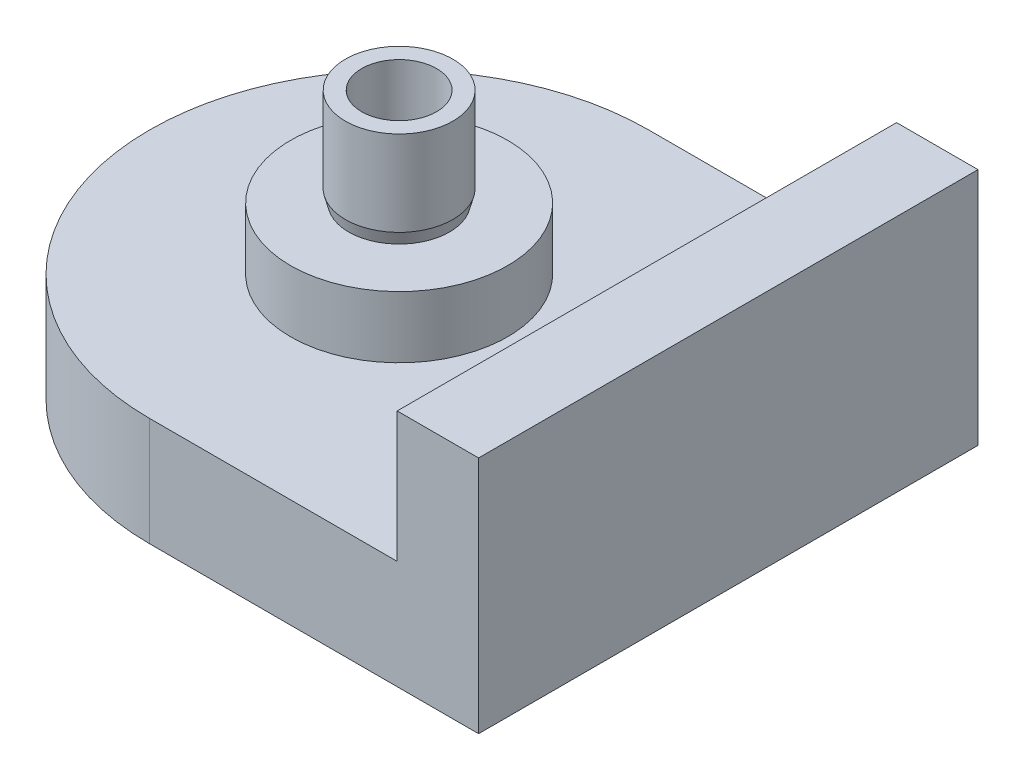
ISO-10303-21;
HEADER;
FILE_DESCRIPTION(('STEP AP214'),'2;1');
FILE_NAME('part.step','',(''),(''),'','','');
FILE_SCHEMA(('AUTOMOTIVE_DESIGN { 1 0 10303 214 1 1 1 1 }'));
ENDSEC;
DATA;
#1=APPLICATION_CONTEXT('core data for automotive mechanical design processes');
#2=APPLICATION_PROTOCOL_DEFINITION('international standard','automotive_design',2000,#1);
#3=PRODUCT_CONTEXT('',#1,'mechanical');
#4=PRODUCT('Part','Part','',(#3));
#5=PRODUCT_RELATED_PRODUCT_CATEGORY('part','',(#4));
#6=PRODUCT_DEFINITION_FORMATION('','',#4);
#7=PRODUCT_DEFINITION_CONTEXT('part definition',#1,'design');
#8=PRODUCT_DEFINITION('design','',#6,#7);
#9=PRODUCT_DEFINITION_SHAPE('','',#8);
#10=(LENGTH_UNIT() NAMED_UNIT(*) SI_UNIT(.MILLI.,.METRE.));
#11=(NAMED_UNIT(*) PLANE_ANGLE_UNIT() SI_UNIT($,.RADIAN.));
#12=(NAMED_UNIT(*) SI_UNIT($,.STERADIAN.) SOLID_ANGLE_UNIT());
#13=UNCERTAINTY_MEASURE_WITH_UNIT(LENGTH_MEASURE(1.E-05),#10,'distance_accuracy_value','');
#14=(GEOMETRIC_REPRESENTATION_CONTEXT(3) GLOBAL_UNCERTAINTY_ASSIGNED_CONTEXT((#13)) GLOBAL_UNIT_ASSIGNED_CONTEXT((#10,
#11,#12)) REPRESENTATION_CONTEXT('',''));
#15=CARTESIAN_POINT('',(0.,0.,0.));
#16=DIRECTION('',(0.,0.,1.));
#17=DIRECTION('',(1.,0.,0.));
#18=AXIS2_PLACEMENT_3D('',#15,#16,#17);
#19=CARTESIAN_POINT('',(0.,5.,0.));
#20=DIRECTION('',(0.,1.,0.));
#21=DIRECTION('',(0.,0.,1.));
#22=AXIS2_PLACEMENT_3D('',#19,#20,#21);
#23=PLANE('',#22);
#24=CARTESIAN_POINT('',(0.,5.,0.));
#25=DIRECTION('',(0.,1.,0.));
#26=DIRECTION('',(0.,0.,1.));
#27=AXIS2_PLACEMENT_3D('',#24,#25,#26);
#28=CIRCLE('',#27,5.);
#29=CARTESIAN_POINT('',(0.,5.,5.));
#30=VERTEX_POINT('',#29);
#31=EDGE_CURVE('E238',#30,#30,#28,.T.);
#32=ORIENTED_EDGE('',*,*,#31,.F.);
#33=EDGE_LOOP('',(#32));
#34=FACE_BOUND('',#33,.T.);
#35=DIRECTION('',(-1.,0.,0.));
#36=VECTOR('',#35,1.);
#37=CARTESIAN_POINT('',(0.,5.,11.5));
#38=LINE('',#37,#36);
#39=CARTESIAN_POINT('',(11.4102698840265,5.,11.5));
#40=VERTEX_POINT('',#39);
#41=CARTESIAN_POINT('',(0.,5.,11.5));
#42=VERTEX_POINT('',#41);
#43=EDGE_CURVE('E58',#40,#42,#38,.T.);
#44=ORIENTED_EDGE('',*,*,#43,.F.);
#45=DIRECTION('',(0.,0.,1.));
#46=VECTOR('',#45,1.);
#47=CARTESIAN_POINT('',(11.4102698840265,5.,-11.5));
#48=LINE('',#47,#46);
#49=CARTESIAN_POINT('',(11.4102698840265,5.,4.));
#50=VERTEX_POINT('',#49);
#51=EDGE_CURVE('E152',#50,#40,#48,.T.);
#52=ORIENTED_EDGE('',*,*,#51,.F.);
#53=DIRECTION('',(1.,0.,0.));
#54=VECTOR('',#53,1.);
#55=CARTESIAN_POINT('',(0.,5.,4.));
#56=LINE('',#55,#54);
#57=CARTESIAN_POINT('',(10.3102698840265,5.,4.));
#58=VERTEX_POINT('',#57);
#59=EDGE_CURVE('E172',#58,#50,#56,.T.);
#60=ORIENTED_EDGE('',*,*,#59,.F.);
#61=DIRECTION('',(0.,0.,1.));
#62=VECTOR('',#61,1.);
#63=CARTESIAN_POINT('',(10.3102698840265,5.,0.));
#64=LINE('',#63,#62);
#65=CARTESIAN_POINT('',(10.3102698840265,5.,-4.));
#66=VERTEX_POINT('',#65);
#67=EDGE_CURVE('E168',#66,#58,#64,.T.);
#68=ORIENTED_EDGE('',*,*,#67,.F.);
#69=DIRECTION('',(1.,0.,0.));
#70=VECTOR('',#69,1.);
#71=CARTESIAN_POINT('',(0.,5.,-4.00000000000001));
#72=LINE('',#71,#70);
#73=CARTESIAN_POINT('',(11.4102698840265,5.,-4.));
#74=VERTEX_POINT('',#73);
#75=EDGE_CURVE('E165',#66,#74,#72,.T.);
#76=ORIENTED_EDGE('',*,*,#75,.T.);
#77=CARTESIAN_POINT('',(11.4102698840265,5.,-11.5));
#78=VERTEX_POINT('',#77);
#79=EDGE_CURVE('E65',#78,#74,#48,.T.);
#80=ORIENTED_EDGE('',*,*,#79,.F.);
#81=DIRECTION('',(1.,0.,0.));
#82=VECTOR('',#81,1.);
#83=CARTESIAN_POINT('',(0.,5.,-11.5));
#84=LINE('',#83,#82);
#85=CARTESIAN_POINT('',(0.,5.,-11.5));
#86=VERTEX_POINT('',#85);
#87=EDGE_CURVE('E189',#86,#78,#84,.T.);
#88=ORIENTED_EDGE('',*,*,#87,.F.);
#89=CARTESIAN_POINT('',(0.,5.,0.));
#90=DIRECTION('',(0.,1.,0.));
#91=DIRECTION('',(0.,0.,1.));
#92=AXIS2_PLACEMENT_3D('',#89,#90,#91);
#93=CIRCLE('',#92,11.5);
#94=EDGE_CURVE('E243',#86,#42,#93,.T.);
#95=ORIENTED_EDGE('',*,*,#94,.T.);
#96=EDGE_LOOP('',(#44,#52,#60,#68,#76,#80,#88,#95));
#97=FACE_BOUND('',#96,.T.);
#98=ADVANCED_FACE('F42',(#34,#97),#23,.T.);
#99=CARTESIAN_POINT('',(0.,0.,0.));
#100=DIRECTION('',(0.,1.,0.));
#101=DIRECTION('',(0.,0.,1.));
#102=AXIS2_PLACEMENT_3D('',#99,#100,#101);
#103=PLANE('',#102);
#104=CARTESIAN_POINT('',(0.,0.,0.));
#105=DIRECTION('',(0.,1.,0.));
#106=DIRECTION('',(0.,0.,1.));
#107=AXIS2_PLACEMENT_3D('',#104,#105,#106);
#108=CIRCLE('',#107,1.8);
#109=CARTESIAN_POINT('',(0.,0.,1.8));
#110=VERTEX_POINT('',#109);
#111=EDGE_CURVE('E216',#110,#110,#108,.T.);
#112=ORIENTED_EDGE('',*,*,#111,.T.);
#113=EDGE_LOOP('',(#112));
#114=FACE_BOUND('',#113,.T.);
#115=CARTESIAN_POINT('',(0.,0.,0.));
#116=DIRECTION('',(0.,1.,0.));
#117=DIRECTION('',(0.,0.,1.));
#118=AXIS2_PLACEMENT_3D('',#115,#116,#117);
#119=CIRCLE('',#118,11.5);
#120=CARTESIAN_POINT('',(0.,0.,-11.5));
#121=VERTEX_POINT('',#120);
#122=CARTESIAN_POINT('',(0.,0.,11.5));
#123=VERTEX_POINT('',#122);
#124=EDGE_CURVE('E237',#121,#123,#119,.T.);
#125=ORIENTED_EDGE('',*,*,#124,.F.);
#126=DIRECTION('',(1.,0.,0.));
#127=VECTOR('',#126,1.);
#128=CARTESIAN_POINT('',(0.,0.,-11.5));
#129=LINE('',#128,#127);
#130=CARTESIAN_POINT('',(15.1602698840265,0.,-11.5));
#131=VERTEX_POINT('',#130);
#132=EDGE_CURVE('E180',#121,#131,#129,.T.);
#133=ORIENTED_EDGE('',*,*,#132,.T.);
#134=DIRECTION('',(0.,0.,1.));
#135=VECTOR('',#134,1.);
#136=CARTESIAN_POINT('',(15.1602698840265,0.,11.5));
#137=LINE('',#136,#135);
#138=CARTESIAN_POINT('',(15.1602698840265,0.,11.5));
#139=VERTEX_POINT('',#138);
#140=EDGE_CURVE('E127',#131,#139,#137,.T.);
#141=ORIENTED_EDGE('',*,*,#140,.T.);
#142=DIRECTION('',(-1.,0.,0.));
#143=VECTOR('',#142,1.);
#144=CARTESIAN_POINT('',(0.,0.,11.5));
#145=LINE('',#144,#143);
#146=EDGE_CURVE('E192',#139,#123,#145,.T.);
#147=ORIENTED_EDGE('',*,*,#146,.T.);
#148=EDGE_LOOP('',(#125,#133,#141,#147));
#149=FACE_BOUND('',#148,.T.);
#150=DIRECTION('',(0.,0.,1.));
#151=VECTOR('',#150,1.);
#152=CARTESIAN_POINT('',(11.4102698840265,0.,0.));
#153=LINE('',#152,#151);
#154=CARTESIAN_POINT('',(11.4102698840265,0.,-4.));
#155=VERTEX_POINT('',#154);
#156=CARTESIAN_POINT('',(11.4102698840265,0.,4.));
#157=VERTEX_POINT('',#156);
#158=EDGE_CURVE('E12',#155,#157,#153,.T.);
#159=ORIENTED_EDGE('',*,*,#158,.F.);
#160=DIRECTION('',(1.,0.,0.));
#161=VECTOR('',#160,1.);
#162=CARTESIAN_POINT('',(0.,0.,-4.00000000000001));
#163=LINE('',#162,#161);
#164=CARTESIAN_POINT('',(10.3102698840265,0.,-4.));
#165=VERTEX_POINT('',#164);
#166=EDGE_CURVE('E242',#165,#155,#163,.T.);
#167=ORIENTED_EDGE('',*,*,#166,.F.);
#168=DIRECTION('',(0.,0.,1.));
#169=VECTOR('',#168,1.);
#170=CARTESIAN_POINT('',(10.3102698840265,0.,0.));
#171=LINE('',#170,#169);
#172=CARTESIAN_POINT('',(10.3102698840265,0.,4.));
#173=VERTEX_POINT('',#172);
#174=EDGE_CURVE('E256',#165,#173,#171,.T.);
#175=ORIENTED_EDGE('',*,*,#174,.T.);
#176=DIRECTION('',(1.,0.,0.));
#177=VECTOR('',#176,1.);
#178=CARTESIAN_POINT('',(0.,0.,4.));
#179=LINE('',#178,#177);
#180=EDGE_CURVE('E51',#173,#157,#179,.T.);
#181=ORIENTED_EDGE('',*,*,#180,.T.);
#182=EDGE_LOOP('',(#159,#167,#175,#181));
#183=FACE_BOUND('',#182,.T.);
#184=ADVANCED_FACE('F263',(#114,#149,#183),#103,.F.);
#185=CARTESIAN_POINT('',(0.,5.,0.));
#186=DIRECTION('',(0.,-1.,0.));
#187=DIRECTION('',(0.,0.,-1.));
#188=AXIS2_PLACEMENT_3D('',#185,#186,#187);
#189=CYLINDRICAL_SURFACE('',#188,11.5);
#190=DIRECTION('',(0.,-1.,0.));
#191=VECTOR('',#190,1.);
#192=CARTESIAN_POINT('',(0.,5.,11.5));
#193=LINE('',#192,#191);
#194=EDGE_CURVE('E202',#42,#123,#193,.T.);
#195=ORIENTED_EDGE('',*,*,#194,.F.);
#196=ORIENTED_EDGE('',*,*,#94,.F.);
#197=DIRECTION('',(0.,-1.,0.));
#198=VECTOR('',#197,1.);
#199=CARTESIAN_POINT('',(0.,5.,-11.5));
#200=LINE('',#199,#198);
#201=EDGE_CURVE('E133',#86,#121,#200,.T.);
#202=ORIENTED_EDGE('',*,*,#201,.T.);
#203=ORIENTED_EDGE('',*,*,#124,.T.);
#204=EDGE_LOOP('',(#195,#196,#202,#203));
#205=FACE_BOUND('',#204,.T.);
#206=ADVANCED_FACE('F44',(#205),#189,.T.);
#207=CARTESIAN_POINT('',(0.,7.84,0.));
#208=DIRECTION('',(0.,-1.,0.));
#209=DIRECTION('',(0.,0.,-1.));
#210=AXIS2_PLACEMENT_3D('',#207,#208,#209);
#211=CYLINDRICAL_SURFACE('',#210,5.);
#212=CARTESIAN_POINT('',(0.,7.84,0.));
#213=DIRECTION('',(0.,1.,0.));
#214=DIRECTION('',(0.,0.,1.));
#215=AXIS2_PLACEMENT_3D('',#212,#213,#214);
#216=CIRCLE('',#215,5.);
#217=CARTESIAN_POINT('',(0.,7.84,5.));
#218=VERTEX_POINT('',#217);
#219=EDGE_CURVE('E233',#218,#218,#216,.T.);
#220=ORIENTED_EDGE('',*,*,#219,.F.);
#221=EDGE_LOOP('',(#220));
#222=FACE_BOUND('',#221,.T.);
#223=ORIENTED_EDGE('',*,*,#31,.T.);
#224=EDGE_LOOP('',(#223));
#225=FACE_BOUND('',#224,.T.);
#226=ADVANCED_FACE('F299',(#222,#225),#211,.T.);
#227=CARTESIAN_POINT('',(0.,7.84,0.));
#228=DIRECTION('',(0.,1.,0.));
#229=DIRECTION('',(0.,0.,1.));
#230=AXIS2_PLACEMENT_3D('',#227,#228,#229);
#231=PLANE('',#230);
#232=ORIENTED_EDGE('',*,*,#219,.T.);
#233=EDGE_LOOP('',(#232));
#234=FACE_BOUND('',#233,.T.);
#235=CARTESIAN_POINT('',(0.,7.84,0.));
#236=DIRECTION('',(0.,1.,0.));
#237=DIRECTION('',(0.,0.,1.));
#238=AXIS2_PLACEMENT_3D('',#235,#236,#237);
#239=CIRCLE('',#238,2.32079933352687);
#240=CARTESIAN_POINT('',(0.,7.84,2.32079933352687));
#241=VERTEX_POINT('',#240);
#242=EDGE_CURVE('E206',#241,#241,#239,.T.);
#243=ORIENTED_EDGE('',*,*,#242,.F.);
#244=EDGE_LOOP('',(#243));
#245=FACE_BOUND('',#244,.T.);
#246=ADVANCED_FACE('F302',(#234,#245),#231,.T.);
#247=CARTESIAN_POINT('',(0.,12.34,0.));
#248=DIRECTION('',(0.,1.,0.));
#249=DIRECTION('',(0.,0.,1.));
#250=AXIS2_PLACEMENT_3D('',#247,#248,#249);
#251=PLANE('',#250);
#252=CARTESIAN_POINT('',(0.,12.34,0.));
#253=DIRECTION('',(0.,1.,0.));
#254=DIRECTION('',(0.,0.,1.));
#255=AXIS2_PLACEMENT_3D('',#252,#253,#254);
#256=CIRCLE('',#255,2.475);
#257=CARTESIAN_POINT('',(0.,12.34,2.475));
#258=VERTEX_POINT('',#257);
#259=EDGE_CURVE('E229',#258,#258,#256,.T.);
#260=ORIENTED_EDGE('',*,*,#259,.T.);
#261=EDGE_LOOP('',(#260));
#262=FACE_BOUND('',#261,.T.);
#263=CARTESIAN_POINT('',(0.,12.34,0.));
#264=DIRECTION('',(0.,1.,0.));
#265=DIRECTION('',(0.,0.,1.));
#266=AXIS2_PLACEMENT_3D('',#263,#264,#265);
#267=CIRCLE('',#266,1.725);
#268=CARTESIAN_POINT('',(0.,12.34,1.725));
#269=VERTEX_POINT('',#268);
#270=EDGE_CURVE('E225',#269,#269,#267,.T.);
#271=ORIENTED_EDGE('',*,*,#270,.F.);
#272=EDGE_LOOP('',(#271));
#273=FACE_BOUND('',#272,.T.);
#274=ADVANCED_FACE('F306',(#262,#273),#251,.T.);
#275=CARTESIAN_POINT('',(0.,12.34,0.));
#276=DIRECTION('',(0.,-1.,0.));
#277=DIRECTION('',(0.,0.,-1.));
#278=AXIS2_PLACEMENT_3D('',#275,#276,#277);
#279=CYLINDRICAL_SURFACE('',#278,2.475);
#280=CARTESIAN_POINT('',(0.,8.41548472183872,0.));
#281=DIRECTION('',(0.,1.,0.));
#282=DIRECTION('',(0.,0.,1.));
#283=AXIS2_PLACEMENT_3D('',#280,#281,#282);
#284=CIRCLE('',#283,2.475);
#285=CARTESIAN_POINT('',(0.,8.41548472183872,2.475));
#286=VERTEX_POINT('',#285);
#287=EDGE_CURVE('E215',#286,#286,#284,.T.);
#288=ORIENTED_EDGE('',*,*,#287,.T.);
#289=EDGE_LOOP('',(#288));
#290=FACE_BOUND('',#289,.T.);
#291=ORIENTED_EDGE('',*,*,#259,.F.);
#292=EDGE_LOOP('',(#291));
#293=FACE_BOUND('',#292,.T.);
#294=ADVANCED_FACE('F308',(#290,#293),#279,.T.);
#295=CARTESIAN_POINT('',(0.,12.34,0.));
#296=DIRECTION('',(0.,-1.,0.));
#297=DIRECTION('',(0.,0.,-1.));
#298=AXIS2_PLACEMENT_3D('',#295,#296,#297);
#299=CYLINDRICAL_SURFACE('',#298,1.725);
#300=ORIENTED_EDGE('',*,*,#270,.T.);
#301=EDGE_LOOP('',(#300));
#302=FACE_BOUND('',#301,.T.);
#303=CARTESIAN_POINT('',(0.,7.84,0.));
#304=DIRECTION('',(0.,1.,0.));
#305=DIRECTION('',(0.,0.,1.));
#306=AXIS2_PLACEMENT_3D('',#303,#304,#305);
#307=CIRCLE('',#306,1.725);
#308=CARTESIAN_POINT('',(0.,7.84,1.725));
#309=VERTEX_POINT('',#308);
#310=EDGE_CURVE('E220',#309,#309,#307,.F.);
#311=ORIENTED_EDGE('',*,*,#310,.T.);
#312=EDGE_LOOP('',(#311));
#313=FACE_BOUND('',#312,.T.);
#314=ADVANCED_FACE('F311',(#302,#313),#299,.F.);
#315=CARTESIAN_POINT('',(0.,7.84,0.));
#316=DIRECTION('',(0.,1.,0.));
#317=DIRECTION('',(0.,0.,1.));
#318=AXIS2_PLACEMENT_3D('',#315,#316,#317);
#319=PLANE('',#318);
#320=CARTESIAN_POINT('',(0.,7.84,0.));
#321=DIRECTION('',(0.,1.,0.));
#322=DIRECTION('',(0.,0.,1.));
#323=AXIS2_PLACEMENT_3D('',#320,#321,#322);
#324=CIRCLE('',#323,1.8);
#325=CARTESIAN_POINT('',(0.,7.84,1.8));
#326=VERTEX_POINT('',#325);
#327=EDGE_CURVE('E221',#326,#326,#324,.T.);
#328=ORIENTED_EDGE('',*,*,#327,.F.);
#329=EDGE_LOOP('',(#328));
#330=FACE_BOUND('',#329,.T.);
#331=ORIENTED_EDGE('',*,*,#310,.F.);
#332=EDGE_LOOP('',(#331));
#333=FACE_BOUND('',#332,.T.);
#334=ADVANCED_FACE('F318',(#330,#333),#319,.F.);
#335=CARTESIAN_POINT('',(0.,0.,0.));
#336=DIRECTION('',(0.,1.,0.));
#337=DIRECTION('',(0.,0.,1.));
#338=AXIS2_PLACEMENT_3D('',#335,#336,#337);
#339=CYLINDRICAL_SURFACE('',#338,1.8);
#340=ORIENTED_EDGE('',*,*,#111,.F.);
#341=EDGE_LOOP('',(#340));
#342=FACE_BOUND('',#341,.T.);
#343=ORIENTED_EDGE('',*,*,#327,.T.);
#344=EDGE_LOOP('',(#343));
#345=FACE_BOUND('',#344,.T.);
#346=ADVANCED_FACE('F320',(#342,#345),#339,.F.);
#347=CARTESIAN_POINT('',(0.,7.84,0.));
#348=DIRECTION('',(0.,1.,0.));
#349=DIRECTION('',(0.,0.,1.));
#350=AXIS2_PLACEMENT_3D('',#347,#348,#349);
#351=CONICAL_SURFACE('',#350,2.32079933352687,0.26179938779915);
#352=ORIENTED_EDGE('',*,*,#242,.T.);
#353=EDGE_LOOP('',(#352));
#354=FACE_BOUND('',#353,.T.);
#355=ORIENTED_EDGE('',*,*,#287,.F.);
#356=EDGE_LOOP('',(#355));
#357=FACE_BOUND('',#356,.T.);
#358=ADVANCED_FACE('F323',(#354,#357),#351,.T.);
#359=CARTESIAN_POINT('',(0.,5.,11.5));
#360=DIRECTION('',(0.,0.,1.));
#361=DIRECTION('',(1.,0.,0.));
#362=AXIS2_PLACEMENT_3D('',#359,#360,#361);
#363=PLANE('',#362);
#364=ORIENTED_EDGE('',*,*,#146,.F.);
#365=DIRECTION('',(0.,-1.,0.));
#366=VECTOR('',#365,1.);
#367=CARTESIAN_POINT('',(15.1602698840265,5.,11.5));
#368=LINE('',#367,#366);
#369=CARTESIAN_POINT('',(15.1602698840265,11.,11.5));
#370=VERTEX_POINT('',#369);
#371=EDGE_CURVE('E132',#370,#139,#368,.T.);
#372=ORIENTED_EDGE('',*,*,#371,.F.);
#373=DIRECTION('',(1.,0.,0.));
#374=VECTOR('',#373,1.);
#375=CARTESIAN_POINT('',(15.1602698840265,11.,11.5));
#376=LINE('',#375,#374);
#377=CARTESIAN_POINT('',(11.4102698840265,11.,11.5));
#378=VERTEX_POINT('',#377);
#379=EDGE_CURVE('E148',#378,#370,#376,.T.);
#380=ORIENTED_EDGE('',*,*,#379,.F.);
#381=DIRECTION('',(0.,-1.,0.));
#382=VECTOR('',#381,1.);
#383=CARTESIAN_POINT('',(11.4102698840265,11.,11.5));
#384=LINE('',#383,#382);
#385=EDGE_CURVE('E158',#378,#40,#384,.T.);
#386=ORIENTED_EDGE('',*,*,#385,.T.);
#387=ORIENTED_EDGE('',*,*,#43,.T.);
#388=ORIENTED_EDGE('',*,*,#194,.T.);
#389=EDGE_LOOP('',(#364,#372,#380,#386,#387,#388));
#390=FACE_BOUND('',#389,.T.);
#391=ADVANCED_FACE('F330',(#390),#363,.T.);
#392=CARTESIAN_POINT('',(15.1602698840265,5.,11.5));
#393=DIRECTION('',(1.,0.,0.));
#394=DIRECTION('',(0.,0.,-1.));
#395=AXIS2_PLACEMENT_3D('',#392,#393,#394);
#396=PLANE('',#395);
#397=ORIENTED_EDGE('',*,*,#140,.F.);
#398=DIRECTION('',(0.,-1.,0.));
#399=VECTOR('',#398,1.);
#400=CARTESIAN_POINT('',(15.1602698840265,5.,-11.5));
#401=LINE('',#400,#399);
#402=CARTESIAN_POINT('',(15.1602698840265,11.,-11.5));
#403=VERTEX_POINT('',#402);
#404=EDGE_CURVE('E121',#403,#131,#401,.T.);
#405=ORIENTED_EDGE('',*,*,#404,.F.);
#406=DIRECTION('',(0.,0.,-1.));
#407=VECTOR('',#406,1.);
#408=CARTESIAN_POINT('',(15.1602698840265,11.,-11.5));
#409=LINE('',#408,#407);
#410=EDGE_CURVE('E125',#370,#403,#409,.T.);
#411=ORIENTED_EDGE('',*,*,#410,.F.);
#412=ORIENTED_EDGE('',*,*,#371,.T.);
#413=EDGE_LOOP('',(#397,#405,#411,#412));
#414=FACE_BOUND('',#413,.T.);
#415=ADVANCED_FACE('F123',(#414),#396,.T.);
#416=CARTESIAN_POINT('',(0.,5.,-11.5));
#417=DIRECTION('',(0.,0.,-1.));
#418=DIRECTION('',(-1.,0.,0.));
#419=AXIS2_PLACEMENT_3D('',#416,#417,#418);
#420=PLANE('',#419);
#421=ORIENTED_EDGE('',*,*,#132,.F.);
#422=ORIENTED_EDGE('',*,*,#201,.F.);
#423=ORIENTED_EDGE('',*,*,#87,.T.);
#424=DIRECTION('',(0.,-1.,0.));
#425=VECTOR('',#424,1.);
#426=CARTESIAN_POINT('',(11.4102698840265,11.,-11.5));
#427=LINE('',#426,#425);
#428=CARTESIAN_POINT('',(11.4102698840265,11.,-11.5));
#429=VERTEX_POINT('',#428);
#430=EDGE_CURVE('E139',#429,#78,#427,.T.);
#431=ORIENTED_EDGE('',*,*,#430,.F.);
#432=DIRECTION('',(-1.,0.,0.));
#433=VECTOR('',#432,1.);
#434=CARTESIAN_POINT('',(15.1602698840265,11.,-11.5));
#435=LINE('',#434,#433);
#436=EDGE_CURVE('E136',#403,#429,#435,.T.);
#437=ORIENTED_EDGE('',*,*,#436,.F.);
#438=ORIENTED_EDGE('',*,*,#404,.T.);
#439=EDGE_LOOP('',(#421,#422,#423,#431,#437,#438));
#440=FACE_BOUND('',#439,.T.);
#441=ADVANCED_FACE('F137',(#440),#420,.T.);
#442=CARTESIAN_POINT('',(11.4102698840265,-5.,0.));
#443=DIRECTION('',(-1.,0.,0.));
#444=DIRECTION('',(0.,0.,1.));
#445=AXIS2_PLACEMENT_3D('',#442,#443,#444);
#446=PLANE('',#445);
#447=ORIENTED_EDGE('',*,*,#158,.T.);
#448=DIRECTION('',(0.,1.,0.));
#449=VECTOR('',#448,1.);
#450=CARTESIAN_POINT('',(11.4102698840265,-5.,4.));
#451=LINE('',#450,#449);
#452=EDGE_CURVE('E176',#157,#50,#451,.T.);
#453=ORIENTED_EDGE('',*,*,#452,.T.);
#454=ORIENTED_EDGE('',*,*,#51,.T.);
#455=ORIENTED_EDGE('',*,*,#385,.F.);
#456=DIRECTION('',(0.,0.,1.));
#457=VECTOR('',#456,1.);
#458=CARTESIAN_POINT('',(11.4102698840265,11.,-11.5));
#459=LINE('',#458,#457);
#460=EDGE_CURVE('E143',#429,#378,#459,.T.);
#461=ORIENTED_EDGE('',*,*,#460,.F.);
#462=ORIENTED_EDGE('',*,*,#430,.T.);
#463=ORIENTED_EDGE('',*,*,#79,.T.);
#464=DIRECTION('',(0.,1.,0.));
#465=VECTOR('',#464,1.);
#466=CARTESIAN_POINT('',(11.4102698840265,-5.,-4.));
#467=LINE('',#466,#465);
#468=EDGE_CURVE('E175',#155,#74,#467,.T.);
#469=ORIENTED_EDGE('',*,*,#468,.F.);
#470=EDGE_LOOP('',(#447,#453,#454,#455,#461,#462,#463,#469));
#471=FACE_BOUND('',#470,.T.);
#472=ADVANCED_FACE('F276',(#471),#446,.T.);
#473=CARTESIAN_POINT('',(0.,-5.,4.));
#474=DIRECTION('',(0.,0.,1.));
#475=DIRECTION('',(1.,0.,0.));
#476=AXIS2_PLACEMENT_3D('',#473,#474,#475);
#477=PLANE('',#476);
#478=DIRECTION('',(0.,1.,0.));
#479=VECTOR('',#478,1.);
#480=CARTESIAN_POINT('',(10.3102698840265,-5.,4.));
#481=LINE('',#480,#479);
#482=EDGE_CURVE('E181',#173,#58,#481,.T.);
#483=ORIENTED_EDGE('',*,*,#482,.T.);
#484=ORIENTED_EDGE('',*,*,#59,.T.);
#485=ORIENTED_EDGE('',*,*,#452,.F.);
#486=ORIENTED_EDGE('',*,*,#180,.F.);
#487=EDGE_LOOP('',(#483,#484,#485,#486));
#488=FACE_BOUND('',#487,.T.);
#489=ADVANCED_FACE('F269',(#488),#477,.F.);
#490=CARTESIAN_POINT('',(10.3102698840265,-5.,0.));
#491=DIRECTION('',(-1.,0.,0.));
#492=DIRECTION('',(0.,0.,1.));
#493=AXIS2_PLACEMENT_3D('',#490,#491,#492);
#494=PLANE('',#493);
#495=DIRECTION('',(0.,1.,0.));
#496=VECTOR('',#495,1.);
#497=CARTESIAN_POINT('',(10.3102698840265,-5.,-4.));
#498=LINE('',#497,#496);
#499=EDGE_CURVE('E184',#165,#66,#498,.T.);
#500=ORIENTED_EDGE('',*,*,#499,.T.);
#501=ORIENTED_EDGE('',*,*,#67,.T.);
#502=ORIENTED_EDGE('',*,*,#482,.F.);
#503=ORIENTED_EDGE('',*,*,#174,.F.);
#504=EDGE_LOOP('',(#500,#501,#502,#503));
#505=FACE_BOUND('',#504,.T.);
#506=ADVANCED_FACE('F271',(#505),#494,.F.);
#507=CARTESIAN_POINT('',(0.,-5.,-4.00000000000001));
#508=DIRECTION('',(0.,0.,1.));
#509=DIRECTION('',(1.,0.,0.));
#510=AXIS2_PLACEMENT_3D('',#507,#508,#509);
#511=PLANE('',#510);
#512=ORIENTED_EDGE('',*,*,#166,.T.);
#513=ORIENTED_EDGE('',*,*,#468,.T.);
#514=ORIENTED_EDGE('',*,*,#75,.F.);
#515=ORIENTED_EDGE('',*,*,#499,.F.);
#516=EDGE_LOOP('',(#512,#513,#514,#515));
#517=FACE_BOUND('',#516,.T.);
#518=ADVANCED_FACE('F280',(#517),#511,.T.);
#519=CARTESIAN_POINT('',(0.,11.,0.));
#520=DIRECTION('',(0.,-1.,0.));
#521=DIRECTION('',(0.,0.,-1.));
#522=AXIS2_PLACEMENT_3D('',#519,#520,#521);
#523=PLANE('',#522);
#524=ORIENTED_EDGE('',*,*,#410,.T.);
#525=ORIENTED_EDGE('',*,*,#436,.T.);
#526=ORIENTED_EDGE('',*,*,#460,.T.);
#527=ORIENTED_EDGE('',*,*,#379,.T.);
#528=EDGE_LOOP('',(#524,#525,#526,#527));
#529=FACE_BOUND('',#528,.T.);
#530=ADVANCED_FACE('F146',(#529),#523,.F.);
#531=CLOSED_SHELL('',(#98,#184,#206,#226,#246,#274,#294,#314,#334,#346,#358,#391,#415,#441,#472,
#489,#506,#518,#530));
#532=MANIFOLD_SOLID_BREP('B2',#531);
#533=ADVANCED_BREP_SHAPE_REPRESENTATION('',(#18,#532),#14);
#534=SHAPE_DEFINITION_REPRESENTATION(#9,#533);
ENDSEC;
END-ISO-10303-21;
